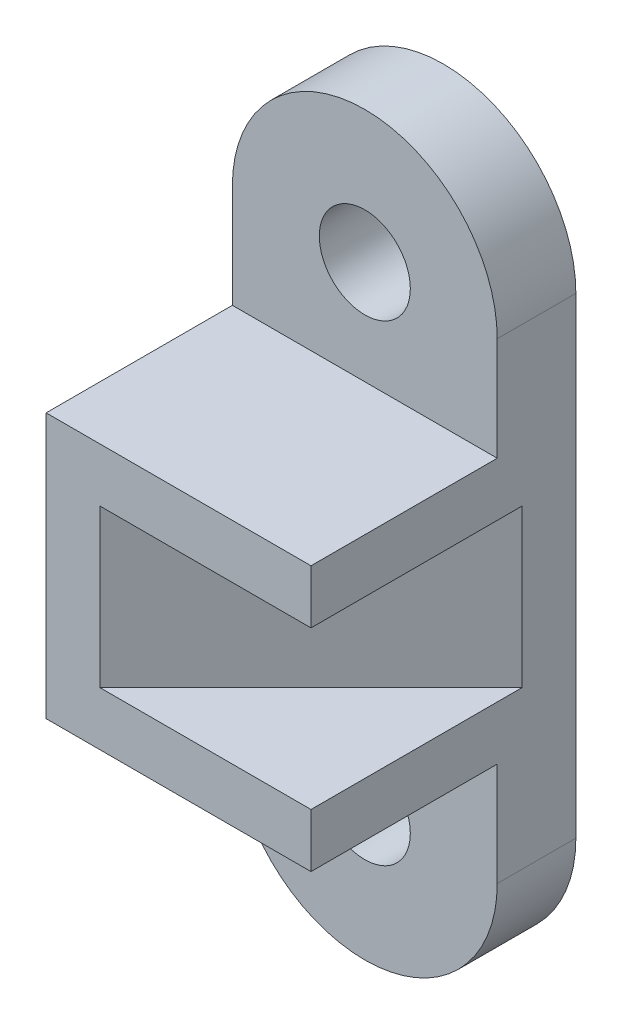
ISO-10303-21;
HEADER;
FILE_DESCRIPTION(('STEP AP214'),'2;1');
FILE_NAME('part.step','',(''),(''),'','','');
FILE_SCHEMA(('AUTOMOTIVE_DESIGN { 1 0 10303 214 1 1 1 1 }'));
ENDSEC;
DATA;
#1=APPLICATION_CONTEXT('core data for automotive mechanical design processes');
#2=APPLICATION_PROTOCOL_DEFINITION('international standard','automotive_design',2000,#1);
#3=PRODUCT_CONTEXT('',#1,'mechanical');
#4=PRODUCT('Part','Part','',(#3));
#5=PRODUCT_RELATED_PRODUCT_CATEGORY('part','',(#4));
#6=PRODUCT_DEFINITION_FORMATION('','',#4);
#7=PRODUCT_DEFINITION_CONTEXT('part definition',#1,'design');
#8=PRODUCT_DEFINITION('design','',#6,#7);
#9=PRODUCT_DEFINITION_SHAPE('','',#8);
#10=(LENGTH_UNIT() NAMED_UNIT(*) SI_UNIT(.MILLI.,.METRE.));
#11=(NAMED_UNIT(*) PLANE_ANGLE_UNIT() SI_UNIT($,.RADIAN.));
#12=(NAMED_UNIT(*) SI_UNIT($,.STERADIAN.) SOLID_ANGLE_UNIT());
#13=UNCERTAINTY_MEASURE_WITH_UNIT(LENGTH_MEASURE(1.E-05),#10,'distance_accuracy_value','');
#14=(GEOMETRIC_REPRESENTATION_CONTEXT(3) GLOBAL_UNCERTAINTY_ASSIGNED_CONTEXT((#13)) GLOBAL_UNIT_ASSIGNED_CONTEXT((#10,
#11,#12)) REPRESENTATION_CONTEXT('',''));
#15=CARTESIAN_POINT('',(0.,0.,0.));
#16=DIRECTION('',(0.,0.,1.));
#17=DIRECTION('',(1.,0.,0.));
#18=AXIS2_PLACEMENT_3D('',#15,#16,#17);
#19=CARTESIAN_POINT('',(0.,38.,13.));
#20=DIRECTION('',(0.,-1.,0.));
#21=DIRECTION('',(0.,0.,-1.));
#22=AXIS2_PLACEMENT_3D('',#19,#20,#21);
#23=PLANE('',#22);
#24=DIRECTION('',(0.707106781186548,0.,-0.707106781186548));
#25=VECTOR('',#24,1.);
#26=CARTESIAN_POINT('',(0.,38.,13.));
#27=LINE('',#26,#25);
#28=CARTESIAN_POINT('',(-51.,38.,64.));
#29=VERTEX_POINT('',#28);
#30=CARTESIAN_POINT('',(0.,38.,13.));
#31=VERTEX_POINT('',#30);
#32=EDGE_CURVE('E138',#29,#31,#27,.T.);
#33=ORIENTED_EDGE('',*,*,#32,.F.);
#34=DIRECTION('',(1.,0.,0.));
#35=VECTOR('',#34,1.);
#36=CARTESIAN_POINT('',(0.,38.,64.));
#37=LINE('',#36,#35);
#38=CARTESIAN_POINT('',(0.,38.,64.));
#39=VERTEX_POINT('',#38);
#40=EDGE_CURVE('E141',#29,#39,#37,.T.);
#41=ORIENTED_EDGE('',*,*,#40,.T.);
#42=DIRECTION('',(0.,0.,1.));
#43=VECTOR('',#42,1.);
#44=CARTESIAN_POINT('',(0.,38.,13.));
#45=LINE('',#44,#43);
#46=EDGE_CURVE('E129',#31,#39,#45,.T.);
#47=ORIENTED_EDGE('',*,*,#46,.F.);
#48=EDGE_LOOP('',(#33,#41,#47));
#49=FACE_BOUND('',#48,.T.);
#50=ADVANCED_FACE('F39',(#49),#23,.F.);
#51=CARTESIAN_POINT('',(-13.,76.,13.));
#52=DIRECTION('',(0.,1.,0.));
#53=DIRECTION('',(-1.,0.,0.));
#54=AXIS2_PLACEMENT_3D('',#51,#52,#53);
#55=PLANE('',#54);
#56=DIRECTION('',(0.707106781186548,0.,-0.707106781186547));
#57=VECTOR('',#56,1.);
#58=CARTESIAN_POINT('',(0.,76.,13.));
#59=LINE('',#58,#57);
#60=CARTESIAN_POINT('',(-51.,76.,64.));
#61=VERTEX_POINT('',#60);
#62=CARTESIAN_POINT('',(0.,76.,13.));
#63=VERTEX_POINT('',#62);
#64=EDGE_CURVE('E132',#61,#63,#59,.T.);
#65=ORIENTED_EDGE('',*,*,#64,.T.);
#66=DIRECTION('',(0.,0.,1.));
#67=VECTOR('',#66,1.);
#68=CARTESIAN_POINT('',(0.,76.,13.));
#69=LINE('',#68,#67);
#70=CARTESIAN_POINT('',(0.,76.,64.));
#71=VERTEX_POINT('',#70);
#72=EDGE_CURVE('E54',#63,#71,#69,.T.);
#73=ORIENTED_EDGE('',*,*,#72,.T.);
#74=DIRECTION('',(-1.,0.,0.));
#75=VECTOR('',#74,1.);
#76=CARTESIAN_POINT('',(-13.,76.,64.));
#77=LINE('',#76,#75);
#78=EDGE_CURVE('E134',#71,#61,#77,.T.);
#79=ORIENTED_EDGE('',*,*,#78,.T.);
#80=EDGE_LOOP('',(#65,#73,#79));
#81=FACE_BOUND('',#80,.T.);
#82=ADVANCED_FACE('F133',(#81),#55,.F.);
#83=CARTESIAN_POINT('',(-32.,0.,19.));
#84=DIRECTION('',(0.,0.,1.));
#85=DIRECTION('',(1.,0.,0.));
#86=AXIS2_PLACEMENT_3D('',#83,#84,#85);
#87=PLANE('',#86);
#88=DIRECTION('',(1.,0.,0.));
#89=VECTOR('',#88,1.);
#90=CARTESIAN_POINT('',(-64.,25.,19.));
#91=LINE('',#90,#89);
#92=CARTESIAN_POINT('',(-64.,25.,19.));
#93=VERTEX_POINT('',#92);
#94=CARTESIAN_POINT('',(0.,25.,19.));
#95=VERTEX_POINT('',#94);
#96=EDGE_CURVE('E62',#93,#95,#91,.T.);
#97=ORIENTED_EDGE('',*,*,#96,.F.);
#98=DIRECTION('',(0.,-1.,0.));
#99=VECTOR('',#98,1.);
#100=CARTESIAN_POINT('',(-64.,0.,19.));
#101=LINE('',#100,#99);
#102=CARTESIAN_POINT('',(-64.,0.,19.));
#103=VERTEX_POINT('',#102);
#104=EDGE_CURVE('E197',#93,#103,#101,.T.);
#105=ORIENTED_EDGE('',*,*,#104,.T.);
#106=CARTESIAN_POINT('',(-32.,0.,19.));
#107=DIRECTION('',(0.,0.,1.));
#108=DIRECTION('',(1.,0.,0.));
#109=AXIS2_PLACEMENT_3D('',#106,#107,#108);
#110=CIRCLE('',#109,32.);
#111=CARTESIAN_POINT('',(0.,0.,19.));
#112=VERTEX_POINT('',#111);
#113=EDGE_CURVE('E188',#103,#112,#110,.T.);
#114=ORIENTED_EDGE('',*,*,#113,.T.);
#115=DIRECTION('',(0.,1.,0.));
#116=VECTOR('',#115,1.);
#117=CARTESIAN_POINT('',(0.,0.,19.));
#118=LINE('',#117,#116);
#119=EDGE_CURVE('E193',#112,#95,#118,.T.);
#120=ORIENTED_EDGE('',*,*,#119,.T.);
#121=EDGE_LOOP('',(#97,#105,#114,#120));
#122=FACE_BOUND('',#121,.T.);
#123=CARTESIAN_POINT('',(-32.,0.,19.));
#124=DIRECTION('',(0.,0.,1.));
#125=DIRECTION('',(1.,0.,0.));
#126=AXIS2_PLACEMENT_3D('',#123,#124,#125);
#127=CIRCLE('',#126,11.);
#128=CARTESIAN_POINT('',(-21.,0.,19.));
#129=VERTEX_POINT('',#128);
#130=EDGE_CURVE('E182',#129,#129,#127,.T.);
#131=ORIENTED_EDGE('',*,*,#130,.F.);
#132=EDGE_LOOP('',(#131));
#133=FACE_BOUND('',#132,.T.);
#134=ADVANCED_FACE('F232',(#122,#133),#87,.T.);
#135=DIRECTION('',(-1.,0.,0.));
#136=VECTOR('',#135,1.);
#137=CARTESIAN_POINT('',(0.,89.,19.));
#138=LINE('',#137,#136);
#139=CARTESIAN_POINT('',(0.,89.,19.));
#140=VERTEX_POINT('',#139);
#141=CARTESIAN_POINT('',(-64.,89.,19.));
#142=VERTEX_POINT('',#141);
#143=EDGE_CURVE('E149',#140,#142,#138,.T.);
#144=ORIENTED_EDGE('',*,*,#143,.F.);
#145=CARTESIAN_POINT('',(0.,114.,19.));
#146=VERTEX_POINT('',#145);
#147=EDGE_CURVE('E191',#140,#146,#118,.T.);
#148=ORIENTED_EDGE('',*,*,#147,.T.);
#149=CARTESIAN_POINT('',(-32.,114.,19.));
#150=DIRECTION('',(0.,0.,1.));
#151=DIRECTION('',(1.,0.,0.));
#152=AXIS2_PLACEMENT_3D('',#149,#150,#151);
#153=CIRCLE('',#152,32.);
#154=CARTESIAN_POINT('',(-64.,114.,19.));
#155=VERTEX_POINT('',#154);
#156=EDGE_CURVE('E195',#146,#155,#153,.T.);
#157=ORIENTED_EDGE('',*,*,#156,.T.);
#158=EDGE_CURVE('E198',#155,#142,#101,.T.);
#159=ORIENTED_EDGE('',*,*,#158,.T.);
#160=EDGE_LOOP('',(#144,#148,#157,#159));
#161=FACE_BOUND('',#160,.T.);
#162=CARTESIAN_POINT('',(-32.,114.,19.));
#163=DIRECTION('',(0.,0.,1.));
#164=DIRECTION('',(1.,0.,0.));
#165=AXIS2_PLACEMENT_3D('',#162,#163,#164);
#166=CIRCLE('',#165,11.);
#167=CARTESIAN_POINT('',(-21.,114.,19.));
#168=VERTEX_POINT('',#167);
#169=EDGE_CURVE('E176',#168,#168,#166,.T.);
#170=ORIENTED_EDGE('',*,*,#169,.F.);
#171=EDGE_LOOP('',(#170));
#172=FACE_BOUND('',#171,.T.);
#173=ADVANCED_FACE('F249',(#161,#172),#87,.T.);
#174=CARTESIAN_POINT('',(-32.,0.,0.));
#175=DIRECTION('',(0.,0.,1.));
#176=DIRECTION('',(1.,0.,0.));
#177=AXIS2_PLACEMENT_3D('',#174,#175,#176);
#178=PLANE('',#177);
#179=CARTESIAN_POINT('',(-32.,0.,0.));
#180=DIRECTION('',(0.,0.,1.));
#181=DIRECTION('',(1.,0.,0.));
#182=AXIS2_PLACEMENT_3D('',#179,#180,#181);
#183=CIRCLE('',#182,32.);
#184=CARTESIAN_POINT('',(-64.,0.,0.));
#185=VERTEX_POINT('',#184);
#186=CARTESIAN_POINT('',(0.,0.,0.));
#187=VERTEX_POINT('',#186);
#188=EDGE_CURVE('E185',#185,#187,#183,.T.);
#189=ORIENTED_EDGE('',*,*,#188,.F.);
#190=DIRECTION('',(0.,-1.,0.));
#191=VECTOR('',#190,1.);
#192=CARTESIAN_POINT('',(-64.,0.,0.));
#193=LINE('',#192,#191);
#194=CARTESIAN_POINT('',(-64.,114.,0.));
#195=VERTEX_POINT('',#194);
#196=EDGE_CURVE('E192',#195,#185,#193,.T.);
#197=ORIENTED_EDGE('',*,*,#196,.F.);
#198=CARTESIAN_POINT('',(-32.,114.,0.));
#199=DIRECTION('',(0.,0.,1.));
#200=DIRECTION('',(1.,0.,0.));
#201=AXIS2_PLACEMENT_3D('',#198,#199,#200);
#202=CIRCLE('',#201,32.);
#203=CARTESIAN_POINT('',(0.,114.,0.));
#204=VERTEX_POINT('',#203);
#205=EDGE_CURVE('E205',#204,#195,#202,.T.);
#206=ORIENTED_EDGE('',*,*,#205,.F.);
#207=DIRECTION('',(0.,1.,0.));
#208=VECTOR('',#207,1.);
#209=CARTESIAN_POINT('',(0.,0.,0.));
#210=LINE('',#209,#208);
#211=EDGE_CURVE('E203',#187,#204,#210,.T.);
#212=ORIENTED_EDGE('',*,*,#211,.F.);
#213=EDGE_LOOP('',(#189,#197,#206,#212));
#214=FACE_BOUND('',#213,.T.);
#215=CARTESIAN_POINT('',(-32.,0.,0.));
#216=DIRECTION('',(0.,0.,1.));
#217=DIRECTION('',(1.,0.,0.));
#218=AXIS2_PLACEMENT_3D('',#215,#216,#217);
#219=CIRCLE('',#218,11.);
#220=CARTESIAN_POINT('',(-21.,0.,0.));
#221=VERTEX_POINT('',#220);
#222=EDGE_CURVE('E179',#221,#221,#219,.T.);
#223=ORIENTED_EDGE('',*,*,#222,.T.);
#224=EDGE_LOOP('',(#223));
#225=FACE_BOUND('',#224,.T.);
#226=CARTESIAN_POINT('',(-32.,114.,0.));
#227=DIRECTION('',(0.,0.,1.));
#228=DIRECTION('',(1.,0.,0.));
#229=AXIS2_PLACEMENT_3D('',#226,#227,#228);
#230=CIRCLE('',#229,11.);
#231=CARTESIAN_POINT('',(-21.,114.,0.));
#232=VERTEX_POINT('',#231);
#233=EDGE_CURVE('E175',#232,#232,#230,.T.);
#234=ORIENTED_EDGE('',*,*,#233,.T.);
#235=EDGE_LOOP('',(#234));
#236=FACE_BOUND('',#235,.T.);
#237=ADVANCED_FACE('F223',(#214,#225,#236),#178,.F.);
#238=CARTESIAN_POINT('',(-32.,0.,19.));
#239=DIRECTION('',(0.,0.,-1.));
#240=DIRECTION('',(-1.,0.,0.));
#241=AXIS2_PLACEMENT_3D('',#238,#239,#240);
#242=CYLINDRICAL_SURFACE('',#241,32.);
#243=ORIENTED_EDGE('',*,*,#188,.T.);
#244=DIRECTION('',(0.,0.,-1.));
#245=VECTOR('',#244,1.);
#246=CARTESIAN_POINT('',(0.,0.,19.));
#247=LINE('',#246,#245);
#248=EDGE_CURVE('E11',#112,#187,#247,.T.);
#249=ORIENTED_EDGE('',*,*,#248,.F.);
#250=ORIENTED_EDGE('',*,*,#113,.F.);
#251=DIRECTION('',(0.,0.,-1.));
#252=VECTOR('',#251,1.);
#253=CARTESIAN_POINT('',(-64.,0.,19.));
#254=LINE('',#253,#252);
#255=EDGE_CURVE('E200',#103,#185,#254,.T.);
#256=ORIENTED_EDGE('',*,*,#255,.T.);
#257=EDGE_LOOP('',(#243,#249,#250,#256));
#258=FACE_BOUND('',#257,.T.);
#259=ADVANCED_FACE('F41',(#258),#242,.T.);
#260=CARTESIAN_POINT('',(0.,0.,19.));
#261=DIRECTION('',(-1.,0.,0.));
#262=DIRECTION('',(0.,0.,1.));
#263=AXIS2_PLACEMENT_3D('',#260,#261,#262);
#264=PLANE('',#263);
#265=DIRECTION('',(0.,1.,0.));
#266=VECTOR('',#265,1.);
#267=CARTESIAN_POINT('',(0.,76.,13.));
#268=LINE('',#267,#266);
#269=EDGE_CURVE('E125',#31,#63,#268,.T.);
#270=ORIENTED_EDGE('',*,*,#269,.F.);
#271=ORIENTED_EDGE('',*,*,#46,.T.);
#272=DIRECTION('',(0.,1.,0.));
#273=VECTOR('',#272,1.);
#274=CARTESIAN_POINT('',(0.,25.,64.));
#275=LINE('',#274,#273);
#276=CARTESIAN_POINT('',(0.,25.,64.));
#277=VERTEX_POINT('',#276);
#278=EDGE_CURVE('E151',#277,#39,#275,.T.);
#279=ORIENTED_EDGE('',*,*,#278,.F.);
#280=DIRECTION('',(0.,0.,-1.));
#281=VECTOR('',#280,1.);
#282=CARTESIAN_POINT('',(0.,25.,64.));
#283=LINE('',#282,#281);
#284=EDGE_CURVE('E160',#277,#95,#283,.T.);
#285=ORIENTED_EDGE('',*,*,#284,.T.);
#286=ORIENTED_EDGE('',*,*,#119,.F.);
#287=ORIENTED_EDGE('',*,*,#248,.T.);
#288=ORIENTED_EDGE('',*,*,#211,.T.);
#289=DIRECTION('',(0.,0.,-1.));
#290=VECTOR('',#289,1.);
#291=CARTESIAN_POINT('',(0.,114.,19.));
#292=LINE('',#291,#290);
#293=EDGE_CURVE('E47',#146,#204,#292,.T.);
#294=ORIENTED_EDGE('',*,*,#293,.F.);
#295=ORIENTED_EDGE('',*,*,#147,.F.);
#296=DIRECTION('',(0.,0.,-1.));
#297=VECTOR('',#296,1.);
#298=CARTESIAN_POINT('',(0.,89.,64.));
#299=LINE('',#298,#297);
#300=CARTESIAN_POINT('',(0.,89.,64.));
#301=VERTEX_POINT('',#300);
#302=EDGE_CURVE('E172',#301,#140,#299,.T.);
#303=ORIENTED_EDGE('',*,*,#302,.F.);
#304=EDGE_CURVE('E128',#71,#301,#275,.T.);
#305=ORIENTED_EDGE('',*,*,#304,.F.);
#306=ORIENTED_EDGE('',*,*,#72,.F.);
#307=EDGE_LOOP('',(#270,#271,#279,#285,#286,#287,#288,#294,#295,#303,#305,#306));
#308=FACE_BOUND('',#307,.T.);
#309=ADVANCED_FACE('F122',(#308),#264,.F.);
#310=CARTESIAN_POINT('',(-32.,114.,19.));
#311=DIRECTION('',(0.,0.,-1.));
#312=DIRECTION('',(-1.,0.,0.));
#313=AXIS2_PLACEMENT_3D('',#310,#311,#312);
#314=CYLINDRICAL_SURFACE('',#313,32.);
#315=ORIENTED_EDGE('',*,*,#205,.T.);
#316=DIRECTION('',(0.,0.,-1.));
#317=VECTOR('',#316,1.);
#318=CARTESIAN_POINT('',(-64.,114.,19.));
#319=LINE('',#318,#317);
#320=EDGE_CURVE('E210',#155,#195,#319,.T.);
#321=ORIENTED_EDGE('',*,*,#320,.F.);
#322=ORIENTED_EDGE('',*,*,#156,.F.);
#323=ORIENTED_EDGE('',*,*,#293,.T.);
#324=EDGE_LOOP('',(#315,#321,#322,#323));
#325=FACE_BOUND('',#324,.T.);
#326=ADVANCED_FACE('F217',(#325),#314,.T.);
#327=CARTESIAN_POINT('',(-64.,0.,19.));
#328=DIRECTION('',(1.,0.,0.));
#329=DIRECTION('',(0.,0.,-1.));
#330=AXIS2_PLACEMENT_3D('',#327,#328,#329);
#331=PLANE('',#330);
#332=ORIENTED_EDGE('',*,*,#196,.T.);
#333=ORIENTED_EDGE('',*,*,#255,.F.);
#334=ORIENTED_EDGE('',*,*,#104,.F.);
#335=DIRECTION('',(0.,0.,-1.));
#336=VECTOR('',#335,1.);
#337=CARTESIAN_POINT('',(-64.,25.,64.));
#338=LINE('',#337,#336);
#339=CARTESIAN_POINT('',(-64.,25.,64.));
#340=VERTEX_POINT('',#339);
#341=EDGE_CURVE('E166',#340,#93,#338,.T.);
#342=ORIENTED_EDGE('',*,*,#341,.F.);
#343=DIRECTION('',(0.,-1.,0.));
#344=VECTOR('',#343,1.);
#345=CARTESIAN_POINT('',(-64.,89.,64.));
#346=LINE('',#345,#344);
#347=CARTESIAN_POINT('',(-64.,89.,64.));
#348=VERTEX_POINT('',#347);
#349=EDGE_CURVE('E156',#348,#340,#346,.T.);
#350=ORIENTED_EDGE('',*,*,#349,.F.);
#351=DIRECTION('',(0.,0.,-1.));
#352=VECTOR('',#351,1.);
#353=CARTESIAN_POINT('',(-64.,89.,64.));
#354=LINE('',#353,#352);
#355=EDGE_CURVE('E169',#348,#142,#354,.T.);
#356=ORIENTED_EDGE('',*,*,#355,.T.);
#357=ORIENTED_EDGE('',*,*,#158,.F.);
#358=ORIENTED_EDGE('',*,*,#320,.T.);
#359=EDGE_LOOP('',(#332,#333,#334,#342,#350,#356,#357,#358));
#360=FACE_BOUND('',#359,.T.);
#361=ADVANCED_FACE('F227',(#360),#331,.F.);
#362=CARTESIAN_POINT('',(-32.,0.,19.));
#363=DIRECTION('',(0.,0.,-1.));
#364=DIRECTION('',(-1.,0.,0.));
#365=AXIS2_PLACEMENT_3D('',#362,#363,#364);
#366=CYLINDRICAL_SURFACE('',#365,11.);
#367=ORIENTED_EDGE('',*,*,#130,.T.);
#368=EDGE_LOOP('',(#367));
#369=FACE_BOUND('',#368,.T.);
#370=ORIENTED_EDGE('',*,*,#222,.F.);
#371=EDGE_LOOP('',(#370));
#372=FACE_BOUND('',#371,.T.);
#373=ADVANCED_FACE('F258',(#369,#372),#366,.F.);
#374=CARTESIAN_POINT('',(-32.,114.,19.));
#375=DIRECTION('',(0.,0.,-1.));
#376=DIRECTION('',(-1.,0.,0.));
#377=AXIS2_PLACEMENT_3D('',#374,#375,#376);
#378=CYLINDRICAL_SURFACE('',#377,11.);
#379=ORIENTED_EDGE('',*,*,#169,.T.);
#380=EDGE_LOOP('',(#379));
#381=FACE_BOUND('',#380,.T.);
#382=ORIENTED_EDGE('',*,*,#233,.F.);
#383=EDGE_LOOP('',(#382));
#384=FACE_BOUND('',#383,.T.);
#385=ADVANCED_FACE('F255',(#381,#384),#378,.F.);
#386=CARTESIAN_POINT('',(0.,89.,64.));
#387=DIRECTION('',(0.,-1.,0.));
#388=DIRECTION('',(1.,0.,0.));
#389=AXIS2_PLACEMENT_3D('',#386,#387,#388);
#390=PLANE('',#389);
#391=ORIENTED_EDGE('',*,*,#143,.T.);
#392=ORIENTED_EDGE('',*,*,#355,.F.);
#393=DIRECTION('',(-1.,0.,0.));
#394=VECTOR('',#393,1.);
#395=CARTESIAN_POINT('',(0.,89.,64.));
#396=LINE('',#395,#394);
#397=EDGE_CURVE('E154',#301,#348,#396,.T.);
#398=ORIENTED_EDGE('',*,*,#397,.F.);
#399=ORIENTED_EDGE('',*,*,#302,.T.);
#400=EDGE_LOOP('',(#391,#392,#398,#399));
#401=FACE_BOUND('',#400,.T.);
#402=ADVANCED_FACE('F247',(#401),#390,.F.);
#403=CARTESIAN_POINT('',(-64.,25.,64.));
#404=DIRECTION('',(0.,1.,0.));
#405=DIRECTION('',(-1.,0.,0.));
#406=AXIS2_PLACEMENT_3D('',#403,#404,#405);
#407=PLANE('',#406);
#408=ORIENTED_EDGE('',*,*,#96,.T.);
#409=ORIENTED_EDGE('',*,*,#284,.F.);
#410=DIRECTION('',(1.,0.,0.));
#411=VECTOR('',#410,1.);
#412=CARTESIAN_POINT('',(-64.,25.,64.));
#413=LINE('',#412,#411);
#414=EDGE_CURVE('E158',#340,#277,#413,.T.);
#415=ORIENTED_EDGE('',*,*,#414,.F.);
#416=ORIENTED_EDGE('',*,*,#341,.T.);
#417=EDGE_LOOP('',(#408,#409,#415,#416));
#418=FACE_BOUND('',#417,.T.);
#419=ADVANCED_FACE('F238',(#418),#407,.F.);
#420=CARTESIAN_POINT('',(0.,0.,64.));
#421=DIRECTION('',(0.,0.,1.));
#422=DIRECTION('',(1.,0.,0.));
#423=AXIS2_PLACEMENT_3D('',#420,#421,#422);
#424=PLANE('',#423);
#425=ORIENTED_EDGE('',*,*,#40,.F.);
#426=DIRECTION('',(0.,-1.,0.));
#427=VECTOR('',#426,1.);
#428=CARTESIAN_POINT('',(-51.,76.,64.));
#429=LINE('',#428,#427);
#430=EDGE_CURVE('E143',#61,#29,#429,.T.);
#431=ORIENTED_EDGE('',*,*,#430,.F.);
#432=ORIENTED_EDGE('',*,*,#78,.F.);
#433=ORIENTED_EDGE('',*,*,#304,.T.);
#434=ORIENTED_EDGE('',*,*,#397,.T.);
#435=ORIENTED_EDGE('',*,*,#349,.T.);
#436=ORIENTED_EDGE('',*,*,#414,.T.);
#437=ORIENTED_EDGE('',*,*,#278,.T.);
#438=EDGE_LOOP('',(#425,#431,#432,#433,#434,#435,#436,#437));
#439=FACE_BOUND('',#438,.T.);
#440=ADVANCED_FACE('F243',(#439),#424,.T.);
#441=CARTESIAN_POINT('',(0.,146.002,13.));
#442=DIRECTION('',(-0.707106781186548,0.,-0.707106781186548));
#443=DIRECTION('',(-0.707106781186548,0.,0.707106781186547));
#444=AXIS2_PLACEMENT_3D('',#441,#442,#443);
#445=PLANE('',#444);
#446=ORIENTED_EDGE('',*,*,#64,.F.);
#447=ORIENTED_EDGE('',*,*,#430,.T.);
#448=ORIENTED_EDGE('',*,*,#32,.T.);
#449=ORIENTED_EDGE('',*,*,#269,.T.);
#450=EDGE_LOOP('',(#446,#447,#448,#449));
#451=FACE_BOUND('',#450,.T.);
#452=ADVANCED_FACE('F140',(#451),#445,.F.);
#453=CLOSED_SHELL('',(#50,#82,#134,#173,#237,#259,#309,#326,#361,#373,#385,#402,#419,#440,#452));
#454=MANIFOLD_SOLID_BREP('B2',#453);
#455=ADVANCED_BREP_SHAPE_REPRESENTATION('',(#18,#454),#14);
#456=SHAPE_DEFINITION_REPRESENTATION(#9,#455);
ENDSEC;
END-ISO-10303-21;
